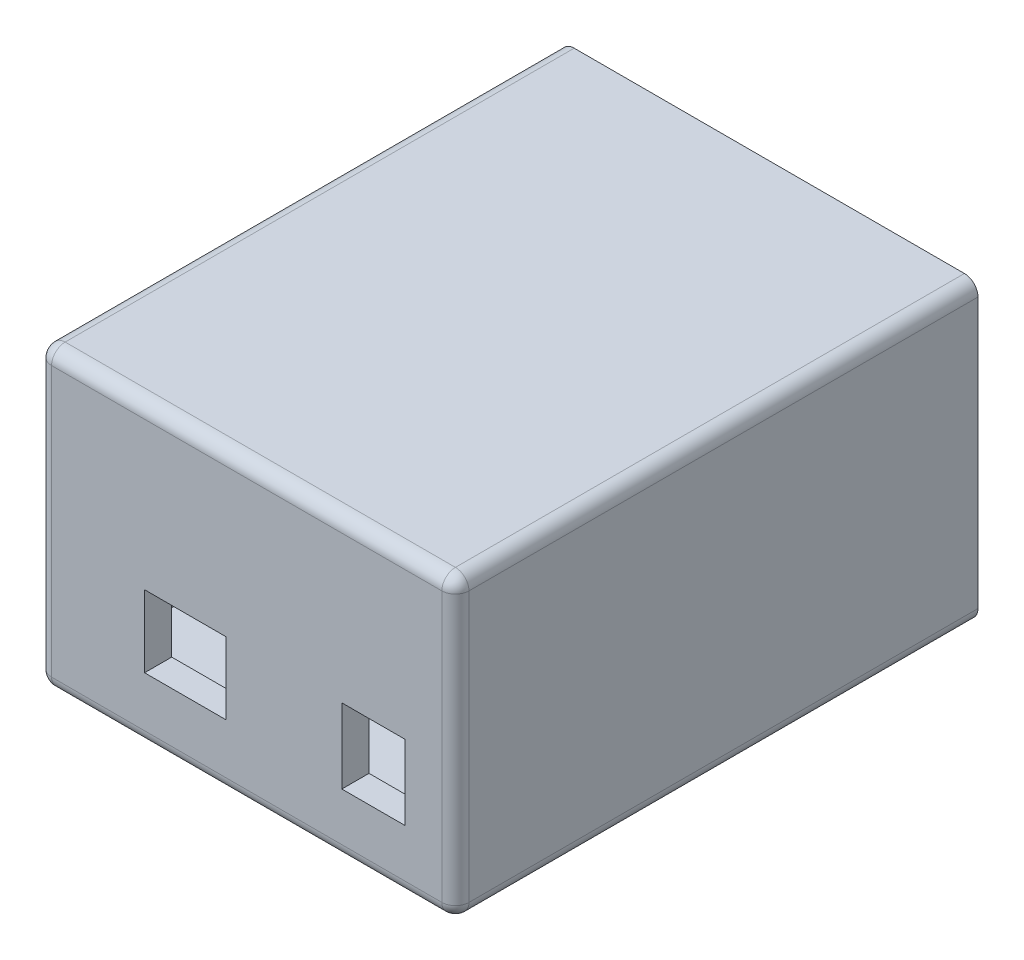
ISO-10303-21;
HEADER;
FILE_DESCRIPTION(('STEP AP214'),'2;1');
FILE_NAME('part.step','',(''),(''),'','','');
FILE_SCHEMA(('AUTOMOTIVE_DESIGN { 1 0 10303 214 1 1 1 1 }'));
ENDSEC;
DATA;
#1=APPLICATION_CONTEXT('core data for automotive mechanical design processes');
#2=APPLICATION_PROTOCOL_DEFINITION('international standard','automotive_design',2000,#1);
#3=PRODUCT_CONTEXT('',#1,'mechanical');
#4=PRODUCT('Part','Part','',(#3));
#5=PRODUCT_RELATED_PRODUCT_CATEGORY('part','',(#4));
#6=PRODUCT_DEFINITION_FORMATION('','',#4);
#7=PRODUCT_DEFINITION_CONTEXT('part definition',#1,'design');
#8=PRODUCT_DEFINITION('design','',#6,#7);
#9=PRODUCT_DEFINITION_SHAPE('','',#8);
#10=(LENGTH_UNIT() NAMED_UNIT(*) SI_UNIT(.MILLI.,.METRE.));
#11=(NAMED_UNIT(*) PLANE_ANGLE_UNIT() SI_UNIT($,.RADIAN.));
#12=(NAMED_UNIT(*) SI_UNIT($,.STERADIAN.) SOLID_ANGLE_UNIT());
#13=UNCERTAINTY_MEASURE_WITH_UNIT(LENGTH_MEASURE(1.E-05),#10,'distance_accuracy_value','');
#14=(GEOMETRIC_REPRESENTATION_CONTEXT(3) GLOBAL_UNCERTAINTY_ASSIGNED_CONTEXT((#13)) GLOBAL_UNIT_ASSIGNED_CONTEXT((#10,
#11,#12)) REPRESENTATION_CONTEXT('',''));
#15=CARTESIAN_POINT('',(0.,0.,0.));
#16=DIRECTION('',(0.,0.,1.));
#17=DIRECTION('',(1.,0.,0.));
#18=AXIS2_PLACEMENT_3D('',#15,#16,#17);
#19=CARTESIAN_POINT('',(13.1694974874372,10.976256281407,-0.001000000000001));
#20=DIRECTION('',(-1.,0.,0.));
#21=DIRECTION('',(0.,-1.,0.));
#22=AXIS2_PLACEMENT_3D('',#19,#20,#21);
#23=PLANE('',#22);
#24=DIRECTION('',(0.,-1.,0.));
#25=VECTOR('',#24,1.);
#26=CARTESIAN_POINT('',(13.1694974874372,10.976256281407,73.));
#27=LINE('',#26,#25);
#28=CARTESIAN_POINT('',(13.1694974874372,10.976256281407,73.));
#29=VERTEX_POINT('',#28);
#30=CARTESIAN_POINT('',(13.1694974874372,-0.0237437185929669,73.));
#31=VERTEX_POINT('',#30);
#32=EDGE_CURVE('E240',#29,#31,#27,.T.);
#33=ORIENTED_EDGE('',*,*,#32,.F.);
#34=DIRECTION('',(0.,0.,1.));
#35=VECTOR('',#34,1.);
#36=CARTESIAN_POINT('',(13.1694974874372,10.976256281407,-0.001000000000001));
#37=LINE('',#36,#35);
#38=CARTESIAN_POINT('',(13.1694974874372,10.976256281407,77.));
#39=VERTEX_POINT('',#38);
#40=EDGE_CURVE('E242',#29,#39,#37,.T.);
#41=ORIENTED_EDGE('',*,*,#40,.T.);
#42=DIRECTION('',(0.,-1.,0.));
#43=VECTOR('',#42,1.);
#44=CARTESIAN_POINT('',(13.1694974874372,10.976256281407,77.));
#45=LINE('',#44,#43);
#46=CARTESIAN_POINT('',(13.1694974874372,-0.0237437185929669,77.));
#47=VERTEX_POINT('',#46);
#48=EDGE_CURVE('E247',#39,#47,#45,.T.);
#49=ORIENTED_EDGE('',*,*,#48,.T.);
#50=DIRECTION('',(0.,0.,1.));
#51=VECTOR('',#50,1.);
#52=CARTESIAN_POINT('',(13.1694974874372,-0.0237437185929669,-0.001000000000001));
#53=LINE('',#52,#51);
#54=EDGE_CURVE('E265',#31,#47,#53,.T.);
#55=ORIENTED_EDGE('',*,*,#54,.F.);
#56=EDGE_LOOP('',(#33,#41,#49,#55));
#57=FACE_BOUND('',#56,.T.);
#58=ADVANCED_FACE('F33',(#57),#23,.F.);
#59=CARTESIAN_POINT('',(13.1694974874372,10.976256281407,-0.001000000000001));
#60=DIRECTION('',(0.,-1.,0.));
#61=DIRECTION('',(1.,0.,0.));
#62=AXIS2_PLACEMENT_3D('',#59,#60,#61);
#63=PLANE('',#62);
#64=ORIENTED_EDGE('',*,*,#40,.F.);
#65=DIRECTION('',(1.,0.,0.));
#66=VECTOR('',#65,1.);
#67=CARTESIAN_POINT('',(13.1694974874372,10.976256281407,73.));
#68=LINE('',#67,#66);
#69=CARTESIAN_POINT('',(22.4694974874372,10.976256281407,73.));
#70=VERTEX_POINT('',#69);
#71=EDGE_CURVE('E237',#29,#70,#68,.T.);
#72=ORIENTED_EDGE('',*,*,#71,.T.);
#73=DIRECTION('',(0.,0.,1.));
#74=VECTOR('',#73,1.);
#75=CARTESIAN_POINT('',(22.4694974874372,10.976256281407,-0.001000000000001));
#76=LINE('',#75,#74);
#77=CARTESIAN_POINT('',(22.4694974874372,10.976256281407,77.));
#78=VERTEX_POINT('',#77);
#79=EDGE_CURVE('E270',#70,#78,#76,.T.);
#80=ORIENTED_EDGE('',*,*,#79,.T.);
#81=DIRECTION('',(1.,0.,0.));
#82=VECTOR('',#81,1.);
#83=CARTESIAN_POINT('',(13.1694974874372,10.976256281407,77.));
#84=LINE('',#83,#82);
#85=EDGE_CURVE('E267',#39,#78,#84,.T.);
#86=ORIENTED_EDGE('',*,*,#85,.F.);
#87=EDGE_LOOP('',(#64,#72,#80,#86));
#88=FACE_BOUND('',#87,.T.);
#89=ADVANCED_FACE('F440',(#88),#63,.T.);
#90=CARTESIAN_POINT('',(22.4694974874372,10.976256281407,-0.001000000000001));
#91=DIRECTION('',(-1.,0.,0.));
#92=DIRECTION('',(0.,-1.,0.));
#93=AXIS2_PLACEMENT_3D('',#90,#91,#92);
#94=PLANE('',#93);
#95=ORIENTED_EDGE('',*,*,#79,.F.);
#96=DIRECTION('',(0.,-1.,0.));
#97=VECTOR('',#96,1.);
#98=CARTESIAN_POINT('',(22.4694974874372,10.976256281407,73.));
#99=LINE('',#98,#97);
#100=CARTESIAN_POINT('',(22.4694974874372,-0.0237437185929663,73.));
#101=VERTEX_POINT('',#100);
#102=EDGE_CURVE('E234',#70,#101,#99,.T.);
#103=ORIENTED_EDGE('',*,*,#102,.T.);
#104=DIRECTION('',(0.,0.,1.));
#105=VECTOR('',#104,1.);
#106=CARTESIAN_POINT('',(22.4694974874372,-0.0237437185929663,-0.001000000000001));
#107=LINE('',#106,#105);
#108=CARTESIAN_POINT('',(22.4694974874372,-0.0237437185929663,77.));
#109=VERTEX_POINT('',#108);
#110=EDGE_CURVE('E268',#101,#109,#107,.T.);
#111=ORIENTED_EDGE('',*,*,#110,.T.);
#112=DIRECTION('',(0.,-1.,0.));
#113=VECTOR('',#112,1.);
#114=CARTESIAN_POINT('',(22.4694974874372,10.976256281407,77.));
#115=LINE('',#114,#113);
#116=EDGE_CURVE('E275',#78,#109,#115,.T.);
#117=ORIENTED_EDGE('',*,*,#116,.F.);
#118=EDGE_LOOP('',(#95,#103,#111,#117));
#119=FACE_BOUND('',#118,.T.);
#120=ADVANCED_FACE('F446',(#119),#94,.T.);
#121=CARTESIAN_POINT('',(13.1694974874372,-0.0237437185929669,-0.001000000000001));
#122=DIRECTION('',(0.,-1.,0.));
#123=DIRECTION('',(1.,0.,0.));
#124=AXIS2_PLACEMENT_3D('',#121,#122,#123);
#125=PLANE('',#124);
#126=DIRECTION('',(1.,0.,0.));
#127=VECTOR('',#126,1.);
#128=CARTESIAN_POINT('',(13.1694974874372,-0.0237437185929669,73.));
#129=LINE('',#128,#127);
#130=EDGE_CURVE('E232',#31,#101,#129,.T.);
#131=ORIENTED_EDGE('',*,*,#130,.F.);
#132=ORIENTED_EDGE('',*,*,#54,.T.);
#133=DIRECTION('',(1.,0.,0.));
#134=VECTOR('',#133,1.);
#135=CARTESIAN_POINT('',(13.1694974874372,-0.0237437185929669,77.));
#136=LINE('',#135,#134);
#137=EDGE_CURVE('E278',#47,#109,#136,.T.);
#138=ORIENTED_EDGE('',*,*,#137,.T.);
#139=ORIENTED_EDGE('',*,*,#110,.F.);
#140=EDGE_LOOP('',(#131,#132,#138,#139));
#141=FACE_BOUND('',#140,.T.);
#142=ADVANCED_FACE('F454',(#141),#125,.F.);
#143=CARTESIAN_POINT('',(-15.9005025125628,10.876256281407,-0.001000000000001));
#144=DIRECTION('',(0.,-1.,0.));
#145=DIRECTION('',(0.,0.,-1.));
#146=AXIS2_PLACEMENT_3D('',#143,#144,#145);
#147=PLANE('',#146);
#148=DIRECTION('',(0.,0.,1.));
#149=VECTOR('',#148,1.);
#150=CARTESIAN_POINT('',(-15.9005025125628,10.876256281407,-0.001000000000001));
#151=LINE('',#150,#149);
#152=CARTESIAN_POINT('',(-15.9005025125628,10.876256281407,73.));
#153=VERTEX_POINT('',#152);
#154=CARTESIAN_POINT('',(-15.9005025125628,10.876256281407,77.));
#155=VERTEX_POINT('',#154);
#156=EDGE_CURVE('E256',#153,#155,#151,.T.);
#157=ORIENTED_EDGE('',*,*,#156,.F.);
#158=DIRECTION('',(1.,0.,0.));
#159=VECTOR('',#158,1.);
#160=CARTESIAN_POINT('',(-15.9005025125628,10.876256281407,73.));
#161=LINE('',#160,#159);
#162=CARTESIAN_POINT('',(-3.90050251256281,10.876256281407,73.));
#163=VERTEX_POINT('',#162);
#164=EDGE_CURVE('E229',#153,#163,#161,.T.);
#165=ORIENTED_EDGE('',*,*,#164,.T.);
#166=DIRECTION('',(0.,0.,1.));
#167=VECTOR('',#166,1.);
#168=CARTESIAN_POINT('',(-3.90050251256281,10.876256281407,-0.001000000000001));
#169=LINE('',#168,#167);
#170=CARTESIAN_POINT('',(-3.90050251256281,10.876256281407,77.));
#171=VERTEX_POINT('',#170);
#172=EDGE_CURVE('E262',#163,#171,#169,.T.);
#173=ORIENTED_EDGE('',*,*,#172,.T.);
#174=DIRECTION('',(1.,0.,0.));
#175=VECTOR('',#174,1.);
#176=CARTESIAN_POINT('',(-15.9005025125628,10.876256281407,77.));
#177=LINE('',#176,#175);
#178=EDGE_CURVE('E243',#155,#171,#177,.T.);
#179=ORIENTED_EDGE('',*,*,#178,.F.);
#180=EDGE_LOOP('',(#157,#165,#173,#179));
#181=FACE_BOUND('',#180,.T.);
#182=ADVANCED_FACE('F452',(#181),#147,.T.);
#183=CARTESIAN_POINT('',(-3.90050251256281,10.876256281407,-0.001000000000001));
#184=DIRECTION('',(-1.,0.,0.));
#185=DIRECTION('',(0.,-1.,0.));
#186=AXIS2_PLACEMENT_3D('',#183,#184,#185);
#187=PLANE('',#186);
#188=ORIENTED_EDGE('',*,*,#172,.F.);
#189=DIRECTION('',(0.,-1.,0.));
#190=VECTOR('',#189,1.);
#191=CARTESIAN_POINT('',(-3.90050251256281,10.876256281407,73.));
#192=LINE('',#191,#190);
#193=CARTESIAN_POINT('',(-3.90050251256281,0.276256281407034,73.));
#194=VERTEX_POINT('',#193);
#195=EDGE_CURVE('E226',#163,#194,#192,.T.);
#196=ORIENTED_EDGE('',*,*,#195,.T.);
#197=DIRECTION('',(0.,0.,1.));
#198=VECTOR('',#197,1.);
#199=CARTESIAN_POINT('',(-3.90050251256281,0.276256281407034,-0.001000000000001));
#200=LINE('',#199,#198);
#201=CARTESIAN_POINT('',(-3.90050251256281,0.276256281407034,77.));
#202=VERTEX_POINT('',#201);
#203=EDGE_CURVE('E260',#194,#202,#200,.T.);
#204=ORIENTED_EDGE('',*,*,#203,.T.);
#205=DIRECTION('',(0.,-1.,0.));
#206=VECTOR('',#205,1.);
#207=CARTESIAN_POINT('',(-3.90050251256281,10.876256281407,77.));
#208=LINE('',#207,#206);
#209=EDGE_CURVE('E246',#171,#202,#208,.T.);
#210=ORIENTED_EDGE('',*,*,#209,.F.);
#211=EDGE_LOOP('',(#188,#196,#204,#210));
#212=FACE_BOUND('',#211,.T.);
#213=ADVANCED_FACE('F620',(#212),#187,.T.);
#214=CARTESIAN_POINT('',(-15.9005025125628,0.276256281407034,-0.001000000000001));
#215=DIRECTION('',(0.,-1.,0.));
#216=DIRECTION('',(1.,0.,0.));
#217=AXIS2_PLACEMENT_3D('',#214,#215,#216);
#218=PLANE('',#217);
#219=DIRECTION('',(1.,0.,0.));
#220=VECTOR('',#219,1.);
#221=CARTESIAN_POINT('',(-15.9005025125628,0.276256281407034,73.));
#222=LINE('',#221,#220);
#223=CARTESIAN_POINT('',(-15.9005025125628,0.276256281407034,73.));
#224=VERTEX_POINT('',#223);
#225=EDGE_CURVE('E221',#224,#194,#222,.T.);
#226=ORIENTED_EDGE('',*,*,#225,.F.);
#227=DIRECTION('',(0.,0.,1.));
#228=VECTOR('',#227,1.);
#229=CARTESIAN_POINT('',(-15.9005025125628,0.276256281407034,-0.001000000000001));
#230=LINE('',#229,#228);
#231=CARTESIAN_POINT('',(-15.9005025125628,0.276256281407034,77.));
#232=VERTEX_POINT('',#231);
#233=EDGE_CURVE('E258',#224,#232,#230,.T.);
#234=ORIENTED_EDGE('',*,*,#233,.T.);
#235=DIRECTION('',(1.,0.,0.));
#236=VECTOR('',#235,1.);
#237=CARTESIAN_POINT('',(-15.9005025125628,0.276256281407034,77.));
#238=LINE('',#237,#236);
#239=EDGE_CURVE('E250',#232,#202,#238,.T.);
#240=ORIENTED_EDGE('',*,*,#239,.T.);
#241=ORIENTED_EDGE('',*,*,#203,.F.);
#242=EDGE_LOOP('',(#226,#234,#240,#241));
#243=FACE_BOUND('',#242,.T.);
#244=ADVANCED_FACE('F628',(#243),#218,.F.);
#245=CARTESIAN_POINT('',(-15.9005025125628,10.876256281407,-0.001000000000001));
#246=DIRECTION('',(-1.,0.,0.));
#247=DIRECTION('',(0.,0.,1.));
#248=AXIS2_PLACEMENT_3D('',#245,#246,#247);
#249=PLANE('',#248);
#250=DIRECTION('',(0.,-1.,0.));
#251=VECTOR('',#250,1.);
#252=CARTESIAN_POINT('',(-15.9005025125628,10.876256281407,73.));
#253=LINE('',#252,#251);
#254=EDGE_CURVE('E293',#153,#224,#253,.T.);
#255=ORIENTED_EDGE('',*,*,#254,.F.);
#256=ORIENTED_EDGE('',*,*,#156,.T.);
#257=DIRECTION('',(0.,-1.,0.));
#258=VECTOR('',#257,1.);
#259=CARTESIAN_POINT('',(-15.9005025125628,10.876256281407,77.));
#260=LINE('',#259,#258);
#261=EDGE_CURVE('E253',#155,#232,#260,.T.);
#262=ORIENTED_EDGE('',*,*,#261,.T.);
#263=ORIENTED_EDGE('',*,*,#233,.F.);
#264=EDGE_LOOP('',(#255,#256,#262,#263));
#265=FACE_BOUND('',#264,.T.);
#266=ADVANCED_FACE('F463',(#265),#249,.F.);
#267=CARTESIAN_POINT('',(0.,0.,77.));
#268=DIRECTION('',(0.,0.,1.));
#269=DIRECTION('',(1.,0.,0.));
#270=AXIS2_PLACEMENT_3D('',#267,#268,#269);
#271=PLANE('',#270);
#272=DIRECTION('',(-1.,0.,0.));
#273=VECTOR('',#272,1.);
#274=CARTESIAN_POINT('',(-31.6005025125628,32.626256281407,77.));
#275=LINE('',#274,#273);
#276=CARTESIAN_POINT('',(27.8994974874372,32.626256281407,77.));
#277=VERTEX_POINT('',#276);
#278=CARTESIAN_POINT('',(-29.6005025125628,32.626256281407,77.));
#279=VERTEX_POINT('',#278);
#280=EDGE_CURVE('E322',#277,#279,#275,.T.);
#281=ORIENTED_EDGE('',*,*,#280,.T.);
#282=DIRECTION('',(0.,-1.,0.));
#283=VECTOR('',#282,1.);
#284=CARTESIAN_POINT('',(-29.6005025125628,-9.12374371859297,77.));
#285=LINE('',#284,#283);
#286=CARTESIAN_POINT('',(-29.6005025125628,-7.12374371859297,77.));
#287=VERTEX_POINT('',#286);
#288=EDGE_CURVE('E328',#279,#287,#285,.T.);
#289=ORIENTED_EDGE('',*,*,#288,.T.);
#290=DIRECTION('',(1.,0.,0.));
#291=VECTOR('',#290,1.);
#292=CARTESIAN_POINT('',(29.8994974874372,-7.12374371859297,77.));
#293=LINE('',#292,#291);
#294=CARTESIAN_POINT('',(27.8994974874372,-7.12374371859297,77.));
#295=VERTEX_POINT('',#294);
#296=EDGE_CURVE('E326',#287,#295,#293,.T.);
#297=ORIENTED_EDGE('',*,*,#296,.T.);
#298=DIRECTION('',(0.,1.,0.));
#299=VECTOR('',#298,1.);
#300=CARTESIAN_POINT('',(27.8994974874372,34.626256281407,77.));
#301=LINE('',#300,#299);
#302=EDGE_CURVE('E324',#295,#277,#301,.T.);
#303=ORIENTED_EDGE('',*,*,#302,.T.);
#304=EDGE_LOOP('',(#281,#289,#297,#303));
#305=FACE_BOUND('',#304,.T.);
#306=ORIENTED_EDGE('',*,*,#48,.F.);
#307=ORIENTED_EDGE('',*,*,#85,.T.);
#308=ORIENTED_EDGE('',*,*,#116,.T.);
#309=ORIENTED_EDGE('',*,*,#137,.F.);
#310=EDGE_LOOP('',(#306,#307,#308,#309));
#311=FACE_BOUND('',#310,.T.);
#312=ORIENTED_EDGE('',*,*,#261,.F.);
#313=ORIENTED_EDGE('',*,*,#178,.T.);
#314=ORIENTED_EDGE('',*,*,#209,.T.);
#315=ORIENTED_EDGE('',*,*,#239,.F.);
#316=EDGE_LOOP('',(#312,#313,#314,#315));
#317=FACE_BOUND('',#316,.T.);
#318=ADVANCED_FACE('F394',(#305,#311,#317),#271,.T.);
#319=CARTESIAN_POINT('',(0.,0.,0.));
#320=DIRECTION('',(0.,0.,1.));
#321=DIRECTION('',(1.,0.,0.));
#322=AXIS2_PLACEMENT_3D('',#319,#320,#321);
#323=PLANE('',#322);
#324=DIRECTION('',(-1.,0.,0.));
#325=VECTOR('',#324,1.);
#326=CARTESIAN_POINT('',(25.8994974874372,-5.12374371859296,0.));
#327=LINE('',#326,#325);
#328=CARTESIAN_POINT('',(25.8994974874372,-5.12374371859296,0.));
#329=VERTEX_POINT('',#328);
#330=CARTESIAN_POINT('',(-27.6005025125628,-5.12374371859297,0.));
#331=VERTEX_POINT('',#330);
#332=EDGE_CURVE('E215',#329,#331,#327,.T.);
#333=ORIENTED_EDGE('',*,*,#332,.F.);
#334=DIRECTION('',(0.,-1.,0.));
#335=VECTOR('',#334,1.);
#336=CARTESIAN_POINT('',(25.8994974874372,30.626256281407,0.));
#337=LINE('',#336,#335);
#338=CARTESIAN_POINT('',(25.8994974874372,30.626256281407,0.));
#339=VERTEX_POINT('',#338);
#340=EDGE_CURVE('E188',#339,#329,#337,.T.);
#341=ORIENTED_EDGE('',*,*,#340,.F.);
#342=DIRECTION('',(1.,0.,0.));
#343=VECTOR('',#342,1.);
#344=CARTESIAN_POINT('',(25.8994974874372,30.626256281407,0.));
#345=LINE('',#344,#343);
#346=CARTESIAN_POINT('',(-27.6005025125628,30.626256281407,0.));
#347=VERTEX_POINT('',#346);
#348=EDGE_CURVE('E206',#347,#339,#345,.T.);
#349=ORIENTED_EDGE('',*,*,#348,.F.);
#350=DIRECTION('',(0.,1.,0.));
#351=VECTOR('',#350,1.);
#352=CARTESIAN_POINT('',(-27.6005025125628,30.626256281407,0.));
#353=LINE('',#352,#351);
#354=EDGE_CURVE('E209',#331,#347,#353,.T.);
#355=ORIENTED_EDGE('',*,*,#354,.F.);
#356=EDGE_LOOP('',(#333,#341,#349,#355));
#357=FACE_BOUND('',#356,.T.);
#358=DIRECTION('',(0.,-1.,0.));
#359=VECTOR('',#358,1.);
#360=CARTESIAN_POINT('',(-31.6005025125628,34.626256281407,0.));
#361=LINE('',#360,#359);
#362=CARTESIAN_POINT('',(-31.6005025125628,32.626256281407,0.));
#363=VERTEX_POINT('',#362);
#364=CARTESIAN_POINT('',(-31.6005025125628,-7.12374371859296,0.));
#365=VERTEX_POINT('',#364);
#366=EDGE_CURVE('E264',#363,#365,#361,.T.);
#367=ORIENTED_EDGE('',*,*,#366,.F.);
#368=CARTESIAN_POINT('',(-29.6005025125628,32.626256281407,0.));
#369=DIRECTION('',(0.,0.,1.));
#370=DIRECTION('',(1.,0.,0.));
#371=AXIS2_PLACEMENT_3D('',#368,#369,#370);
#372=CIRCLE('',#371,2.);
#373=CARTESIAN_POINT('',(-29.6005025125628,34.626256281407,0.));
#374=VERTEX_POINT('',#373);
#375=EDGE_CURVE('E308',#363,#374,#372,.F.);
#376=ORIENTED_EDGE('',*,*,#375,.T.);
#377=DIRECTION('',(-1.,0.,0.));
#378=VECTOR('',#377,1.);
#379=CARTESIAN_POINT('',(-31.6005025125628,34.626256281407,0.));
#380=LINE('',#379,#378);
#381=CARTESIAN_POINT('',(27.8994974874372,34.626256281407,0.));
#382=VERTEX_POINT('',#381);
#383=EDGE_CURVE('E290',#382,#374,#380,.T.);
#384=ORIENTED_EDGE('',*,*,#383,.F.);
#385=CARTESIAN_POINT('',(27.8994974874372,32.626256281407,0.));
#386=DIRECTION('',(0.,0.,1.));
#387=DIRECTION('',(1.,0.,0.));
#388=AXIS2_PLACEMENT_3D('',#385,#386,#387);
#389=CIRCLE('',#388,2.);
#390=CARTESIAN_POINT('',(29.8994974874372,32.626256281407,0.));
#391=VERTEX_POINT('',#390);
#392=EDGE_CURVE('E302',#382,#391,#389,.F.);
#393=ORIENTED_EDGE('',*,*,#392,.T.);
#394=DIRECTION('',(0.,1.,0.));
#395=VECTOR('',#394,1.);
#396=CARTESIAN_POINT('',(29.8994974874372,34.626256281407,0.));
#397=LINE('',#396,#395);
#398=CARTESIAN_POINT('',(29.8994974874372,-7.12374371859296,0.));
#399=VERTEX_POINT('',#398);
#400=EDGE_CURVE('E288',#399,#391,#397,.T.);
#401=ORIENTED_EDGE('',*,*,#400,.F.);
#402=CARTESIAN_POINT('',(27.8994974874372,-7.12374371859296,0.));
#403=DIRECTION('',(0.,0.,1.));
#404=DIRECTION('',(1.,0.,0.));
#405=AXIS2_PLACEMENT_3D('',#402,#403,#404);
#406=CIRCLE('',#405,2.);
#407=CARTESIAN_POINT('',(27.8994974874372,-9.12374371859297,0.));
#408=VERTEX_POINT('',#407);
#409=EDGE_CURVE('E304',#399,#408,#406,.F.);
#410=ORIENTED_EDGE('',*,*,#409,.T.);
#411=DIRECTION('',(1.,0.,0.));
#412=VECTOR('',#411,1.);
#413=CARTESIAN_POINT('',(-31.6005025125628,-9.12374371859297,0.));
#414=LINE('',#413,#412);
#415=CARTESIAN_POINT('',(-29.6005025125628,-9.12374371859297,0.));
#416=VERTEX_POINT('',#415);
#417=EDGE_CURVE('E285',#416,#408,#414,.T.);
#418=ORIENTED_EDGE('',*,*,#417,.F.);
#419=CARTESIAN_POINT('',(-29.6005025125628,-7.12374371859297,0.));
#420=DIRECTION('',(0.,0.,1.));
#421=DIRECTION('',(1.,0.,0.));
#422=AXIS2_PLACEMENT_3D('',#419,#420,#421);
#423=CIRCLE('',#422,2.);
#424=EDGE_CURVE('E306',#416,#365,#423,.F.);
#425=ORIENTED_EDGE('',*,*,#424,.T.);
#426=EDGE_LOOP('',(#367,#376,#384,#393,#401,#410,#418,#425));
#427=FACE_BOUND('',#426,.T.);
#428=ADVANCED_FACE('F379',(#357,#427),#323,.F.);
#429=CARTESIAN_POINT('',(-31.6005025125628,34.626256281407,77.));
#430=DIRECTION('',(1.,0.,0.));
#431=DIRECTION('',(0.,1.,0.));
#432=AXIS2_PLACEMENT_3D('',#429,#430,#431);
#433=PLANE('',#432);
#434=DIRECTION('',(0.,-1.,0.));
#435=VECTOR('',#434,1.);
#436=CARTESIAN_POINT('',(-31.6005025125628,34.626256281407,75.));
#437=LINE('',#436,#435);
#438=CARTESIAN_POINT('',(-31.6005025125628,-7.12374371859297,75.));
#439=VERTEX_POINT('',#438);
#440=CARTESIAN_POINT('',(-31.6005025125628,32.626256281407,75.));
#441=VERTEX_POINT('',#440);
#442=EDGE_CURVE('E295',#439,#441,#437,.F.);
#443=ORIENTED_EDGE('',*,*,#442,.T.);
#444=DIRECTION('',(0.,0.,-1.));
#445=VECTOR('',#444,1.);
#446=CARTESIAN_POINT('',(-31.6005025125628,32.626256281407,77.));
#447=LINE('',#446,#445);
#448=EDGE_CURVE('E299',#441,#363,#447,.T.);
#449=ORIENTED_EDGE('',*,*,#448,.T.);
#450=ORIENTED_EDGE('',*,*,#366,.T.);
#451=DIRECTION('',(0.,0.,-1.));
#452=VECTOR('',#451,1.);
#453=CARTESIAN_POINT('',(-31.6005025125628,-7.12374371859296,77.));
#454=LINE('',#453,#452);
#455=EDGE_CURVE('E297',#365,#439,#454,.F.);
#456=ORIENTED_EDGE('',*,*,#455,.T.);
#457=EDGE_LOOP('',(#443,#449,#450,#456));
#458=FACE_BOUND('',#457,.T.);
#459=ADVANCED_FACE('F411',(#458),#433,.F.);
#460=CARTESIAN_POINT('',(-31.6005025125628,-9.12374371859297,77.));
#461=DIRECTION('',(0.,1.,0.));
#462=DIRECTION('',(0.,0.,1.));
#463=AXIS2_PLACEMENT_3D('',#460,#461,#462);
#464=PLANE('',#463);
#465=DIRECTION('',(1.,0.,0.));
#466=VECTOR('',#465,1.);
#467=CARTESIAN_POINT('',(-31.6005025125628,-9.12374371859297,75.));
#468=LINE('',#467,#466);
#469=CARTESIAN_POINT('',(27.8994974874372,-9.12374371859297,75.));
#470=VERTEX_POINT('',#469);
#471=CARTESIAN_POINT('',(-29.6005025125628,-9.12374371859297,75.));
#472=VERTEX_POINT('',#471);
#473=EDGE_CURVE('E318',#470,#472,#468,.F.);
#474=ORIENTED_EDGE('',*,*,#473,.T.);
#475=DIRECTION('',(0.,0.,-1.));
#476=VECTOR('',#475,1.);
#477=CARTESIAN_POINT('',(-29.6005025125628,-9.12374371859297,77.));
#478=LINE('',#477,#476);
#479=EDGE_CURVE('E320',#472,#416,#478,.T.);
#480=ORIENTED_EDGE('',*,*,#479,.T.);
#481=ORIENTED_EDGE('',*,*,#417,.T.);
#482=DIRECTION('',(0.,0.,-1.));
#483=VECTOR('',#482,1.);
#484=CARTESIAN_POINT('',(27.8994974874372,-9.12374371859297,77.));
#485=LINE('',#484,#483);
#486=EDGE_CURVE('E316',#408,#470,#485,.F.);
#487=ORIENTED_EDGE('',*,*,#486,.T.);
#488=EDGE_LOOP('',(#474,#480,#481,#487));
#489=FACE_BOUND('',#488,.T.);
#490=ADVANCED_FACE('F403',(#489),#464,.F.);
#491=CARTESIAN_POINT('',(29.8994974874372,34.626256281407,77.));
#492=DIRECTION('',(-1.,0.,0.));
#493=DIRECTION('',(0.,0.,1.));
#494=AXIS2_PLACEMENT_3D('',#491,#492,#493);
#495=PLANE('',#494);
#496=DIRECTION('',(0.,1.,0.));
#497=VECTOR('',#496,1.);
#498=CARTESIAN_POINT('',(29.8994974874372,-9.12374371859297,75.));
#499=LINE('',#498,#497);
#500=CARTESIAN_POINT('',(29.8994974874372,32.626256281407,75.));
#501=VERTEX_POINT('',#500);
#502=CARTESIAN_POINT('',(29.8994974874372,-7.12374371859296,75.));
#503=VERTEX_POINT('',#502);
#504=EDGE_CURVE('E42',#501,#503,#499,.F.);
#505=ORIENTED_EDGE('',*,*,#504,.T.);
#506=DIRECTION('',(0.,0.,-1.));
#507=VECTOR('',#506,1.);
#508=CARTESIAN_POINT('',(29.8994974874372,-7.12374371859296,77.));
#509=LINE('',#508,#507);
#510=EDGE_CURVE('E11',#503,#399,#509,.T.);
#511=ORIENTED_EDGE('',*,*,#510,.T.);
#512=ORIENTED_EDGE('',*,*,#400,.T.);
#513=DIRECTION('',(0.,0.,-1.));
#514=VECTOR('',#513,1.);
#515=CARTESIAN_POINT('',(29.8994974874372,32.626256281407,77.));
#516=LINE('',#515,#514);
#517=EDGE_CURVE('E53',#391,#501,#516,.F.);
#518=ORIENTED_EDGE('',*,*,#517,.T.);
#519=EDGE_LOOP('',(#505,#511,#512,#518));
#520=FACE_BOUND('',#519,.T.);
#521=ADVANCED_FACE('F376',(#520),#495,.F.);
#522=CARTESIAN_POINT('',(-31.6005025125628,34.626256281407,77.));
#523=DIRECTION('',(0.,-1.,0.));
#524=DIRECTION('',(0.,0.,-1.));
#525=AXIS2_PLACEMENT_3D('',#522,#523,#524);
#526=PLANE('',#525);
#527=ORIENTED_EDGE('',*,*,#383,.T.);
#528=DIRECTION('',(0.,0.,-1.));
#529=VECTOR('',#528,1.);
#530=CARTESIAN_POINT('',(-29.6005025125628,34.626256281407,77.));
#531=LINE('',#530,#529);
#532=CARTESIAN_POINT('',(-29.6005025125628,34.626256281407,75.));
#533=VERTEX_POINT('',#532);
#534=EDGE_CURVE('E314',#374,#533,#531,.F.);
#535=ORIENTED_EDGE('',*,*,#534,.T.);
#536=DIRECTION('',(-1.,0.,0.));
#537=VECTOR('',#536,1.);
#538=CARTESIAN_POINT('',(29.8994974874372,34.626256281407,75.));
#539=LINE('',#538,#537);
#540=CARTESIAN_POINT('',(27.8994974874372,34.626256281407,75.));
#541=VERTEX_POINT('',#540);
#542=EDGE_CURVE('E312',#533,#541,#539,.F.);
#543=ORIENTED_EDGE('',*,*,#542,.T.);
#544=DIRECTION('',(0.,0.,-1.));
#545=VECTOR('',#544,1.);
#546=CARTESIAN_POINT('',(27.8994974874372,34.626256281407,77.));
#547=LINE('',#546,#545);
#548=EDGE_CURVE('E310',#541,#382,#547,.T.);
#549=ORIENTED_EDGE('',*,*,#548,.T.);
#550=EDGE_LOOP('',(#527,#535,#543,#549));
#551=FACE_BOUND('',#550,.T.);
#552=ADVANCED_FACE('F420',(#551),#526,.F.);
#553=CARTESIAN_POINT('',(0.,0.,73.));
#554=DIRECTION('',(0.,0.,-1.));
#555=DIRECTION('',(-1.,0.,0.));
#556=AXIS2_PLACEMENT_3D('',#553,#554,#555);
#557=PLANE('',#556);
#558=DIRECTION('',(0.,-1.,0.));
#559=VECTOR('',#558,1.);
#560=CARTESIAN_POINT('',(25.8994974874372,30.626256281407,73.));
#561=LINE('',#560,#559);
#562=CARTESIAN_POINT('',(25.8994974874372,30.626256281407,73.));
#563=VERTEX_POINT('',#562);
#564=CARTESIAN_POINT('',(25.8994974874372,-5.12374371859296,73.));
#565=VERTEX_POINT('',#564);
#566=EDGE_CURVE('E185',#563,#565,#561,.T.);
#567=ORIENTED_EDGE('',*,*,#566,.T.);
#568=DIRECTION('',(-1.,0.,0.));
#569=VECTOR('',#568,1.);
#570=CARTESIAN_POINT('',(25.8994974874372,-5.12374371859296,73.));
#571=LINE('',#570,#569);
#572=CARTESIAN_POINT('',(-27.6005025125628,-5.12374371859297,73.));
#573=VERTEX_POINT('',#572);
#574=EDGE_CURVE('E196',#565,#573,#571,.T.);
#575=ORIENTED_EDGE('',*,*,#574,.T.);
#576=DIRECTION('',(0.,1.,0.));
#577=VECTOR('',#576,1.);
#578=CARTESIAN_POINT('',(-27.6005025125628,30.626256281407,73.));
#579=LINE('',#578,#577);
#580=CARTESIAN_POINT('',(-27.6005025125628,30.626256281407,73.));
#581=VERTEX_POINT('',#580);
#582=EDGE_CURVE('E201',#573,#581,#579,.T.);
#583=ORIENTED_EDGE('',*,*,#582,.T.);
#584=DIRECTION('',(1.,0.,0.));
#585=VECTOR('',#584,1.);
#586=CARTESIAN_POINT('',(25.8994974874372,30.626256281407,73.));
#587=LINE('',#586,#585);
#588=EDGE_CURVE('E193',#581,#563,#587,.T.);
#589=ORIENTED_EDGE('',*,*,#588,.T.);
#590=EDGE_LOOP('',(#567,#575,#583,#589));
#591=FACE_BOUND('',#590,.T.);
#592=ORIENTED_EDGE('',*,*,#254,.T.);
#593=ORIENTED_EDGE('',*,*,#225,.T.);
#594=ORIENTED_EDGE('',*,*,#195,.F.);
#595=ORIENTED_EDGE('',*,*,#164,.F.);
#596=EDGE_LOOP('',(#592,#593,#594,#595));
#597=FACE_BOUND('',#596,.T.);
#598=ORIENTED_EDGE('',*,*,#32,.T.);
#599=ORIENTED_EDGE('',*,*,#130,.T.);
#600=ORIENTED_EDGE('',*,*,#102,.F.);
#601=ORIENTED_EDGE('',*,*,#71,.F.);
#602=EDGE_LOOP('',(#598,#599,#600,#601));
#603=FACE_BOUND('',#602,.T.);
#604=ADVANCED_FACE('F203',(#591,#597,#603),#557,.T.);
#605=CARTESIAN_POINT('',(25.8994974874372,30.626256281407,73.));
#606=DIRECTION('',(1.,0.,0.));
#607=DIRECTION('',(0.,1.,0.));
#608=AXIS2_PLACEMENT_3D('',#605,#606,#607);
#609=PLANE('',#608);
#610=ORIENTED_EDGE('',*,*,#340,.T.);
#611=DIRECTION('',(0.,0.,-1.));
#612=VECTOR('',#611,1.);
#613=CARTESIAN_POINT('',(25.8994974874372,-5.12374371859296,73.));
#614=LINE('',#613,#612);
#615=EDGE_CURVE('E181',#565,#329,#614,.T.);
#616=ORIENTED_EDGE('',*,*,#615,.F.);
#617=ORIENTED_EDGE('',*,*,#566,.F.);
#618=DIRECTION('',(0.,0.,-1.));
#619=VECTOR('',#618,1.);
#620=CARTESIAN_POINT('',(25.8994974874372,30.626256281407,73.));
#621=LINE('',#620,#619);
#622=EDGE_CURVE('E219',#563,#339,#621,.T.);
#623=ORIENTED_EDGE('',*,*,#622,.T.);
#624=EDGE_LOOP('',(#610,#616,#617,#623));
#625=FACE_BOUND('',#624,.T.);
#626=ADVANCED_FACE('F183',(#625),#609,.F.);
#627=CARTESIAN_POINT('',(25.8994974874372,30.626256281407,73.));
#628=DIRECTION('',(0.,1.,0.));
#629=DIRECTION('',(0.,0.,1.));
#630=AXIS2_PLACEMENT_3D('',#627,#628,#629);
#631=PLANE('',#630);
#632=ORIENTED_EDGE('',*,*,#348,.T.);
#633=ORIENTED_EDGE('',*,*,#622,.F.);
#634=ORIENTED_EDGE('',*,*,#588,.F.);
#635=DIRECTION('',(0.,0.,-1.));
#636=VECTOR('',#635,1.);
#637=CARTESIAN_POINT('',(-27.6005025125628,30.626256281407,73.));
#638=LINE('',#637,#636);
#639=EDGE_CURVE('E222',#581,#347,#638,.T.);
#640=ORIENTED_EDGE('',*,*,#639,.T.);
#641=EDGE_LOOP('',(#632,#633,#634,#640));
#642=FACE_BOUND('',#641,.T.);
#643=ADVANCED_FACE('F569',(#642),#631,.F.);
#644=CARTESIAN_POINT('',(-27.6005025125628,30.626256281407,73.));
#645=DIRECTION('',(-1.,0.,0.));
#646=DIRECTION('',(0.,-1.,0.));
#647=AXIS2_PLACEMENT_3D('',#644,#645,#646);
#648=PLANE('',#647);
#649=ORIENTED_EDGE('',*,*,#354,.T.);
#650=ORIENTED_EDGE('',*,*,#639,.F.);
#651=ORIENTED_EDGE('',*,*,#582,.F.);
#652=DIRECTION('',(0.,0.,-1.));
#653=VECTOR('',#652,1.);
#654=CARTESIAN_POINT('',(-27.6005025125628,-5.12374371859297,73.));
#655=LINE('',#654,#653);
#656=EDGE_CURVE('E192',#573,#331,#655,.T.);
#657=ORIENTED_EDGE('',*,*,#656,.T.);
#658=EDGE_LOOP('',(#649,#650,#651,#657));
#659=FACE_BOUND('',#658,.T.);
#660=ADVANCED_FACE('F560',(#659),#648,.F.);
#661=CARTESIAN_POINT('',(25.8994974874372,-5.12374371859296,73.));
#662=DIRECTION('',(0.,-1.,0.));
#663=DIRECTION('',(1.,0.,0.));
#664=AXIS2_PLACEMENT_3D('',#661,#662,#663);
#665=PLANE('',#664);
#666=ORIENTED_EDGE('',*,*,#332,.T.);
#667=ORIENTED_EDGE('',*,*,#656,.F.);
#668=ORIENTED_EDGE('',*,*,#574,.F.);
#669=ORIENTED_EDGE('',*,*,#615,.T.);
#670=EDGE_LOOP('',(#666,#667,#668,#669));
#671=FACE_BOUND('',#670,.T.);
#672=ADVANCED_FACE('F197',(#671),#665,.F.);
#673=CARTESIAN_POINT('',(27.8994974874372,-7.12374371859296,77.));
#674=DIRECTION('',(0.,0.,-1.));
#675=DIRECTION('',(-1.,0.,0.));
#676=AXIS2_PLACEMENT_3D('',#673,#674,#675);
#677=CYLINDRICAL_SURFACE('',#676,2.);
#678=CARTESIAN_POINT('',(27.8994974874372,-7.12374371859297,75.));
#679=DIRECTION('',(0.,0.,1.));
#680=DIRECTION('',(1.,0.,0.));
#681=AXIS2_PLACEMENT_3D('',#678,#679,#680);
#682=CIRCLE('',#681,2.);
#683=EDGE_CURVE('E37',#470,#503,#682,.T.);
#684=ORIENTED_EDGE('',*,*,#683,.F.);
#685=ORIENTED_EDGE('',*,*,#486,.F.);
#686=ORIENTED_EDGE('',*,*,#409,.F.);
#687=ORIENTED_EDGE('',*,*,#510,.F.);
#688=EDGE_LOOP('',(#684,#685,#686,#687));
#689=FACE_BOUND('',#688,.T.);
#690=ADVANCED_FACE('F35',(#689),#677,.T.);
#691=CARTESIAN_POINT('',(27.8994974874372,-7.12374371859297,75.));
#692=DIRECTION('',(0.,0.,1.));
#693=DIRECTION('',(1.,0.,0.));
#694=AXIS2_PLACEMENT_3D('',#691,#692,#693);
#695=SPHERICAL_SURFACE('',#694,2.);
#696=CARTESIAN_POINT('',(27.8994974874372,-7.12374371859297,75.));
#697=DIRECTION('',(1.,0.,0.));
#698=DIRECTION('',(0.,0.,-1.));
#699=AXIS2_PLACEMENT_3D('',#696,#697,#698);
#700=CIRCLE('',#699,2.);
#701=EDGE_CURVE('E359',#470,#295,#700,.F.);
#702=ORIENTED_EDGE('',*,*,#701,.F.);
#703=ORIENTED_EDGE('',*,*,#683,.T.);
#704=CARTESIAN_POINT('',(27.8994974874372,-7.12374371859296,75.));
#705=DIRECTION('',(0.,-1.,0.));
#706=DIRECTION('',(0.,0.,-1.));
#707=AXIS2_PLACEMENT_3D('',#704,#705,#706);
#708=CIRCLE('',#707,2.);
#709=EDGE_CURVE('E361',#295,#503,#708,.F.);
#710=ORIENTED_EDGE('',*,*,#709,.F.);
#711=EDGE_LOOP('',(#702,#703,#710));
#712=FACE_BOUND('',#711,.T.);
#713=ADVANCED_FACE('F370',(#712),#695,.T.);
#714=CARTESIAN_POINT('',(27.8994974874372,32.626256281407,77.));
#715=DIRECTION('',(0.,0.,-1.));
#716=DIRECTION('',(-1.,0.,0.));
#717=AXIS2_PLACEMENT_3D('',#714,#715,#716);
#718=CYLINDRICAL_SURFACE('',#717,2.);
#719=ORIENTED_EDGE('',*,*,#392,.F.);
#720=ORIENTED_EDGE('',*,*,#548,.F.);
#721=CARTESIAN_POINT('',(27.8994974874372,32.626256281407,75.));
#722=DIRECTION('',(0.,0.,1.));
#723=DIRECTION('',(1.,0.,0.));
#724=AXIS2_PLACEMENT_3D('',#721,#722,#723);
#725=CIRCLE('',#724,2.);
#726=EDGE_CURVE('E356',#501,#541,#725,.T.);
#727=ORIENTED_EDGE('',*,*,#726,.F.);
#728=ORIENTED_EDGE('',*,*,#517,.F.);
#729=EDGE_LOOP('',(#719,#720,#727,#728));
#730=FACE_BOUND('',#729,.T.);
#731=ADVANCED_FACE('F385',(#730),#718,.T.);
#732=CARTESIAN_POINT('',(27.8994974874372,0.,75.));
#733=DIRECTION('',(0.,-1.,0.));
#734=DIRECTION('',(0.,0.,-1.));
#735=AXIS2_PLACEMENT_3D('',#732,#733,#734);
#736=CYLINDRICAL_SURFACE('',#735,2.);
#737=ORIENTED_EDGE('',*,*,#709,.T.);
#738=ORIENTED_EDGE('',*,*,#504,.F.);
#739=CARTESIAN_POINT('',(27.8994974874372,32.626256281407,75.));
#740=DIRECTION('',(0.,1.,0.));
#741=DIRECTION('',(0.,0.,1.));
#742=AXIS2_PLACEMENT_3D('',#739,#740,#741);
#743=CIRCLE('',#742,2.);
#744=EDGE_CURVE('E353',#277,#501,#743,.T.);
#745=ORIENTED_EDGE('',*,*,#744,.F.);
#746=ORIENTED_EDGE('',*,*,#302,.F.);
#747=EDGE_LOOP('',(#737,#738,#745,#746));
#748=FACE_BOUND('',#747,.T.);
#749=ADVANCED_FACE('F392',(#748),#736,.T.);
#750=CARTESIAN_POINT('',(0.,-7.12374371859297,75.));
#751=DIRECTION('',(-1.,0.,0.));
#752=DIRECTION('',(0.,0.,1.));
#753=AXIS2_PLACEMENT_3D('',#750,#751,#752);
#754=CYLINDRICAL_SURFACE('',#753,2.);
#755=ORIENTED_EDGE('',*,*,#701,.T.);
#756=ORIENTED_EDGE('',*,*,#296,.F.);
#757=CARTESIAN_POINT('',(-29.6005025125628,-7.12374371859297,75.));
#758=DIRECTION('',(-1.,0.,0.));
#759=DIRECTION('',(0.,0.,1.));
#760=AXIS2_PLACEMENT_3D('',#757,#758,#759);
#761=CIRCLE('',#760,2.);
#762=EDGE_CURVE('E350',#472,#287,#761,.T.);
#763=ORIENTED_EDGE('',*,*,#762,.F.);
#764=ORIENTED_EDGE('',*,*,#473,.F.);
#765=EDGE_LOOP('',(#755,#756,#763,#764));
#766=FACE_BOUND('',#765,.T.);
#767=ADVANCED_FACE('F400',(#766),#754,.T.);
#768=CARTESIAN_POINT('',(-29.6005025125628,-7.12374371859297,77.));
#769=DIRECTION('',(0.,0.,-1.));
#770=DIRECTION('',(-1.,0.,0.));
#771=AXIS2_PLACEMENT_3D('',#768,#769,#770);
#772=CYLINDRICAL_SURFACE('',#771,2.);
#773=ORIENTED_EDGE('',*,*,#424,.F.);
#774=ORIENTED_EDGE('',*,*,#479,.F.);
#775=CARTESIAN_POINT('',(-29.6005025125628,-7.12374371859297,75.));
#776=DIRECTION('',(0.,0.,1.));
#777=DIRECTION('',(1.,0.,0.));
#778=AXIS2_PLACEMENT_3D('',#775,#776,#777);
#779=CIRCLE('',#778,2.);
#780=EDGE_CURVE('E347',#439,#472,#779,.T.);
#781=ORIENTED_EDGE('',*,*,#780,.F.);
#782=ORIENTED_EDGE('',*,*,#455,.F.);
#783=EDGE_LOOP('',(#773,#774,#781,#782));
#784=FACE_BOUND('',#783,.T.);
#785=ADVANCED_FACE('F407',(#784),#772,.T.);
#786=CARTESIAN_POINT('',(27.8994974874372,32.626256281407,75.));
#787=DIRECTION('',(0.,0.,1.));
#788=DIRECTION('',(1.,0.,0.));
#789=AXIS2_PLACEMENT_3D('',#786,#787,#788);
#790=SPHERICAL_SURFACE('',#789,2.);
#791=ORIENTED_EDGE('',*,*,#744,.T.);
#792=ORIENTED_EDGE('',*,*,#726,.T.);
#793=CARTESIAN_POINT('',(27.8994974874372,32.626256281407,75.));
#794=DIRECTION('',(1.,0.,0.));
#795=DIRECTION('',(0.,0.,-1.));
#796=AXIS2_PLACEMENT_3D('',#793,#794,#795);
#797=CIRCLE('',#796,2.);
#798=EDGE_CURVE('E344',#277,#541,#797,.F.);
#799=ORIENTED_EDGE('',*,*,#798,.F.);
#800=EDGE_LOOP('',(#791,#792,#799));
#801=FACE_BOUND('',#800,.T.);
#802=ADVANCED_FACE('F390',(#801),#790,.T.);
#803=CARTESIAN_POINT('',(-29.6005025125628,-7.12374371859297,75.));
#804=DIRECTION('',(0.,0.,1.));
#805=DIRECTION('',(1.,0.,0.));
#806=AXIS2_PLACEMENT_3D('',#803,#804,#805);
#807=SPHERICAL_SURFACE('',#806,2.);
#808=ORIENTED_EDGE('',*,*,#780,.T.);
#809=ORIENTED_EDGE('',*,*,#762,.T.);
#810=CARTESIAN_POINT('',(-29.6005025125628,-7.12374371859297,75.));
#811=DIRECTION('',(0.,-1.,0.));
#812=DIRECTION('',(0.,0.,-1.));
#813=AXIS2_PLACEMENT_3D('',#810,#811,#812);
#814=CIRCLE('',#813,2.);
#815=EDGE_CURVE('E342',#439,#287,#814,.F.);
#816=ORIENTED_EDGE('',*,*,#815,.F.);
#817=EDGE_LOOP('',(#808,#809,#816));
#818=FACE_BOUND('',#817,.T.);
#819=ADVANCED_FACE('F430',(#818),#807,.T.);
#820=CARTESIAN_POINT('',(0.,32.626256281407,75.));
#821=DIRECTION('',(1.,0.,0.));
#822=DIRECTION('',(0.,0.,-1.));
#823=AXIS2_PLACEMENT_3D('',#820,#821,#822);
#824=CYLINDRICAL_SURFACE('',#823,2.);
#825=ORIENTED_EDGE('',*,*,#798,.T.);
#826=ORIENTED_EDGE('',*,*,#542,.F.);
#827=CARTESIAN_POINT('',(-29.6005025125628,32.626256281407,75.));
#828=DIRECTION('',(-1.,0.,0.));
#829=DIRECTION('',(0.,0.,1.));
#830=AXIS2_PLACEMENT_3D('',#827,#828,#829);
#831=CIRCLE('',#830,2.);
#832=EDGE_CURVE('E339',#279,#533,#831,.T.);
#833=ORIENTED_EDGE('',*,*,#832,.F.);
#834=ORIENTED_EDGE('',*,*,#280,.F.);
#835=EDGE_LOOP('',(#825,#826,#833,#834));
#836=FACE_BOUND('',#835,.T.);
#837=ADVANCED_FACE('F424',(#836),#824,.T.);
#838=CARTESIAN_POINT('',(-29.6005025125628,0.,75.));
#839=DIRECTION('',(0.,1.,0.));
#840=DIRECTION('',(-1.,0.,0.));
#841=AXIS2_PLACEMENT_3D('',#838,#839,#840);
#842=CYLINDRICAL_SURFACE('',#841,2.);
#843=ORIENTED_EDGE('',*,*,#815,.T.);
#844=ORIENTED_EDGE('',*,*,#288,.F.);
#845=CARTESIAN_POINT('',(-29.6005025125628,32.626256281407,75.));
#846=DIRECTION('',(0.,1.,0.));
#847=DIRECTION('',(0.,0.,1.));
#848=AXIS2_PLACEMENT_3D('',#845,#846,#847);
#849=CIRCLE('',#848,2.);
#850=EDGE_CURVE('E336',#441,#279,#849,.T.);
#851=ORIENTED_EDGE('',*,*,#850,.F.);
#852=ORIENTED_EDGE('',*,*,#442,.F.);
#853=EDGE_LOOP('',(#843,#844,#851,#852));
#854=FACE_BOUND('',#853,.T.);
#855=ADVANCED_FACE('F428',(#854),#842,.T.);
#856=CARTESIAN_POINT('',(-29.6005025125628,32.626256281407,75.));
#857=DIRECTION('',(0.,0.,1.));
#858=DIRECTION('',(1.,0.,0.));
#859=AXIS2_PLACEMENT_3D('',#856,#857,#858);
#860=SPHERICAL_SURFACE('',#859,2.);
#861=ORIENTED_EDGE('',*,*,#850,.T.);
#862=ORIENTED_EDGE('',*,*,#832,.T.);
#863=CARTESIAN_POINT('',(-29.6005025125628,32.626256281407,75.));
#864=DIRECTION('',(0.,0.,1.));
#865=DIRECTION('',(1.,0.,0.));
#866=AXIS2_PLACEMENT_3D('',#863,#864,#865);
#867=CIRCLE('',#866,2.);
#868=EDGE_CURVE('E333',#441,#533,#867,.F.);
#869=ORIENTED_EDGE('',*,*,#868,.F.);
#870=EDGE_LOOP('',(#861,#862,#869));
#871=FACE_BOUND('',#870,.T.);
#872=ADVANCED_FACE('F426',(#871),#860,.T.);
#873=CARTESIAN_POINT('',(-29.6005025125628,32.626256281407,77.));
#874=DIRECTION('',(0.,0.,-1.));
#875=DIRECTION('',(-1.,0.,0.));
#876=AXIS2_PLACEMENT_3D('',#873,#874,#875);
#877=CYLINDRICAL_SURFACE('',#876,2.);
#878=ORIENTED_EDGE('',*,*,#868,.T.);
#879=ORIENTED_EDGE('',*,*,#534,.F.);
#880=ORIENTED_EDGE('',*,*,#375,.F.);
#881=ORIENTED_EDGE('',*,*,#448,.F.);
#882=EDGE_LOOP('',(#878,#879,#880,#881));
#883=FACE_BOUND('',#882,.T.);
#884=ADVANCED_FACE('F416',(#883),#877,.T.);
#885=CLOSED_SHELL('',(#58,#89,#120,#142,#182,#213,#244,#266,#318,#428,#459,#490,#521,#552,#604,
#626,#643,#660,#672,#690,#713,#731,#749,#767,#785,#802,#819,#837,#855,#872,#884));
#886=MANIFOLD_SOLID_BREP('B2',#885);
#887=ADVANCED_BREP_SHAPE_REPRESENTATION('',(#18,#886),#14);
#888=SHAPE_DEFINITION_REPRESENTATION(#9,#887);
ENDSEC;
END-ISO-10303-21;
